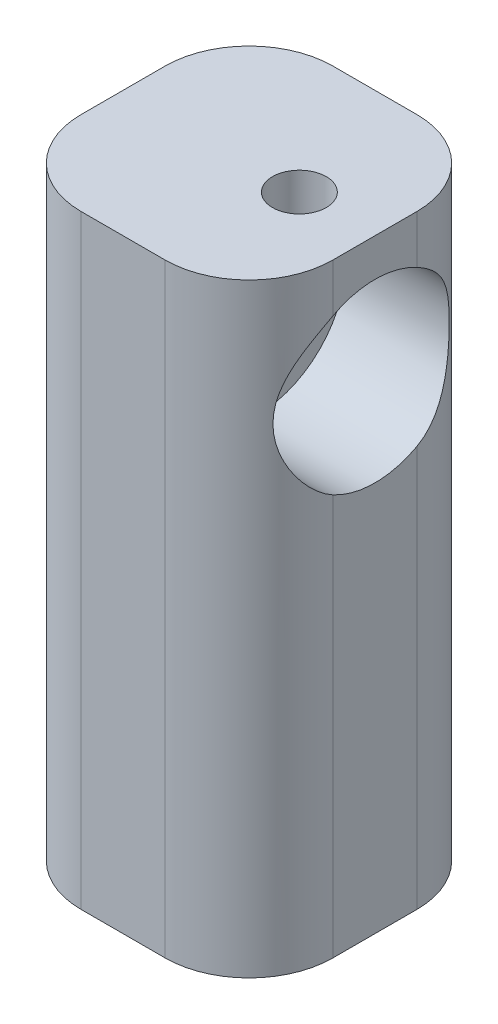
ISO-10303-21;
HEADER;
FILE_DESCRIPTION(('STEP AP214'),'2;1');
FILE_NAME('part.step','',(''),(''),'','','');
FILE_SCHEMA(('AUTOMOTIVE_DESIGN { 1 0 10303 214 1 1 1 1 }'));
ENDSEC;
DATA;
#1=APPLICATION_CONTEXT('core data for automotive mechanical design processes');
#2=APPLICATION_PROTOCOL_DEFINITION('international standard','automotive_design',2000,#1);
#3=PRODUCT_CONTEXT('',#1,'mechanical');
#4=PRODUCT('Part','Part','',(#3));
#5=PRODUCT_RELATED_PRODUCT_CATEGORY('part','',(#4));
#6=PRODUCT_DEFINITION_FORMATION('','',#4);
#7=PRODUCT_DEFINITION_CONTEXT('part definition',#1,'design');
#8=PRODUCT_DEFINITION('design','',#6,#7);
#9=PRODUCT_DEFINITION_SHAPE('','',#8);
#10=(LENGTH_UNIT() NAMED_UNIT(*) SI_UNIT(.MILLI.,.METRE.));
#11=(NAMED_UNIT(*) PLANE_ANGLE_UNIT() SI_UNIT($,.RADIAN.));
#12=(NAMED_UNIT(*) SI_UNIT($,.STERADIAN.) SOLID_ANGLE_UNIT());
#13=UNCERTAINTY_MEASURE_WITH_UNIT(LENGTH_MEASURE(1.E-05),#10,'distance_accuracy_value','');
#14=(GEOMETRIC_REPRESENTATION_CONTEXT(3) GLOBAL_UNCERTAINTY_ASSIGNED_CONTEXT((#13)) GLOBAL_UNIT_ASSIGNED_CONTEXT((#10,
#11,#12)) REPRESENTATION_CONTEXT('',''));
#15=CARTESIAN_POINT('',(0.,0.,0.));
#16=DIRECTION('',(0.,0.,1.));
#17=DIRECTION('',(1.,0.,0.));
#18=AXIS2_PLACEMENT_3D('',#15,#16,#17);
#19=CARTESIAN_POINT('',(-7.5,28.5,0.));
#20=DIRECTION('',(1.,0.,0.));
#21=DIRECTION('',(0.,0.,-1.));
#22=AXIS2_PLACEMENT_3D('',#19,#20,#21);
#23=CYLINDRICAL_SURFACE('',#22,2.5);
#24=CARTESIAN_POINT('',(-7.5,28.5,0.));
#25=DIRECTION('',(1.,0.,0.));
#26=DIRECTION('',(0.,0.,-1.));
#27=AXIS2_PLACEMENT_3D('',#24,#25,#26);
#28=CIRCLE('',#27,2.5);
#29=CARTESIAN_POINT('',(-7.5,28.5,-2.5));
#30=VERTEX_POINT('',#29);
#31=CARTESIAN_POINT('',(-7.5,28.5,2.5));
#32=VERTEX_POINT('',#31);
#33=EDGE_CURVE('E187',#30,#32,#28,.T.);
#34=ORIENTED_EDGE('',*,*,#33,.F.);
#35=EDGE_CURVE('E218',#32,#30,#28,.T.);
#36=ORIENTED_EDGE('',*,*,#35,.F.);
#37=EDGE_LOOP('',(#34,#36));
#38=FACE_BOUND('',#37,.T.);
#39=CARTESIAN_POINT('',(0.5,28.5,0.));
#40=DIRECTION('',(1.,0.,0.));
#41=DIRECTION('',(0.,0.,-1.));
#42=AXIS2_PLACEMENT_3D('',#39,#40,#41);
#43=CIRCLE('',#42,2.5);
#44=CARTESIAN_POINT('',(0.5,28.5,-2.5));
#45=VERTEX_POINT('',#44);
#46=EDGE_CURVE('E133',#45,#45,#43,.F.);
#47=ORIENTED_EDGE('',*,*,#46,.F.);
#48=EDGE_LOOP('',(#47));
#49=FACE_BOUND('',#48,.T.);
#50=ADVANCED_FACE('F40',(#38,#49),#23,.F.);
#51=CARTESIAN_POINT('',(7.5,20.,7.5));
#52=DIRECTION('',(-1.,0.,0.));
#53=DIRECTION('',(0.,0.,1.));
#54=AXIS2_PLACEMENT_3D('',#51,#52,#53);
#55=PLANE('',#54);
#56=DIRECTION('',(0.,-1.,0.));
#57=VECTOR('',#56,1.);
#58=CARTESIAN_POINT('',(7.5,20.,-2.5));
#59=LINE('',#58,#57);
#60=CARTESIAN_POINT('',(7.5,0.,-2.5));
#61=VERTEX_POINT('',#60);
#62=CARTESIAN_POINT('',(7.5,23.8834536718452,-2.5));
#63=VERTEX_POINT('',#62);
#64=EDGE_CURVE('E149',#61,#63,#59,.F.);
#65=ORIENTED_EDGE('',*,*,#64,.T.);
#66=CARTESIAN_POINT('',(7.5,28.5,0.));
#67=DIRECTION('',(1.,0.,0.));
#68=DIRECTION('',(0.,0.,-1.));
#69=AXIS2_PLACEMENT_3D('',#66,#67,#68);
#70=CIRCLE('',#69,5.25);
#71=CARTESIAN_POINT('',(7.5,23.8834536718452,2.5));
#72=VERTEX_POINT('',#71);
#73=EDGE_CURVE('E128',#72,#63,#70,.T.);
#74=ORIENTED_EDGE('',*,*,#73,.F.);
#75=DIRECTION('',(0.,-1.,0.));
#76=VECTOR('',#75,1.);
#77=CARTESIAN_POINT('',(7.5,20.,2.5));
#78=LINE('',#77,#76);
#79=CARTESIAN_POINT('',(7.5,0.,2.5));
#80=VERTEX_POINT('',#79);
#81=EDGE_CURVE('E152',#72,#80,#78,.T.);
#82=ORIENTED_EDGE('',*,*,#81,.T.);
#83=DIRECTION('',(0.,0.,-1.));
#84=VECTOR('',#83,1.);
#85=CARTESIAN_POINT('',(7.5,0.,7.5));
#86=LINE('',#85,#84);
#87=EDGE_CURVE('E242',#80,#61,#86,.T.);
#88=ORIENTED_EDGE('',*,*,#87,.T.);
#89=EDGE_LOOP('',(#65,#74,#82,#88));
#90=FACE_BOUND('',#89,.T.);
#91=ADVANCED_FACE('F203',(#90),#55,.F.);
#92=CARTESIAN_POINT('',(-7.5,20.,7.5));
#93=DIRECTION('',(1.,0.,0.));
#94=DIRECTION('',(0.,0.,-1.));
#95=AXIS2_PLACEMENT_3D('',#92,#93,#94);
#96=PLANE('',#95);
#97=DIRECTION('',(0.,0.,1.));
#98=VECTOR('',#97,1.);
#99=CARTESIAN_POINT('',(-7.5,36.,7.5));
#100=LINE('',#99,#98);
#101=CARTESIAN_POINT('',(-7.5,36.,-2.5));
#102=VERTEX_POINT('',#101);
#103=CARTESIAN_POINT('',(-7.5,36.,2.5));
#104=VERTEX_POINT('',#103);
#105=EDGE_CURVE('E227',#102,#104,#100,.T.);
#106=ORIENTED_EDGE('',*,*,#105,.F.);
#107=DIRECTION('',(0.,-1.,0.));
#108=VECTOR('',#107,1.);
#109=CARTESIAN_POINT('',(-7.5,20.,-2.5));
#110=LINE('',#109,#108);
#111=EDGE_CURVE('E254',#102,#30,#110,.T.);
#112=ORIENTED_EDGE('',*,*,#111,.T.);
#113=ORIENTED_EDGE('',*,*,#33,.T.);
#114=DIRECTION('',(0.,-1.,0.));
#115=VECTOR('',#114,1.);
#116=CARTESIAN_POINT('',(-7.5,20.,2.5));
#117=LINE('',#116,#115);
#118=EDGE_CURVE('E248',#32,#104,#117,.F.);
#119=ORIENTED_EDGE('',*,*,#118,.T.);
#120=EDGE_LOOP('',(#106,#112,#113,#119));
#121=FACE_BOUND('',#120,.T.);
#122=ADVANCED_FACE('F208',(#121),#96,.F.);
#123=CARTESIAN_POINT('',(0.,0.,0.));
#124=DIRECTION('',(0.,1.,0.));
#125=DIRECTION('',(0.,0.,1.));
#126=AXIS2_PLACEMENT_3D('',#123,#124,#125);
#127=PLANE('',#126);
#128=DIRECTION('',(0.,0.,1.));
#129=VECTOR('',#128,1.);
#130=CARTESIAN_POINT('',(-7.5,0.,7.5));
#131=LINE('',#130,#129);
#132=CARTESIAN_POINT('',(-7.5,0.,-2.5));
#133=VERTEX_POINT('',#132);
#134=CARTESIAN_POINT('',(-7.5,0.,2.5));
#135=VERTEX_POINT('',#134);
#136=EDGE_CURVE('E237',#133,#135,#131,.T.);
#137=ORIENTED_EDGE('',*,*,#136,.F.);
#138=CARTESIAN_POINT('',(-2.5,0.,-2.5));
#139=DIRECTION('',(0.,1.,0.));
#140=DIRECTION('',(0.,0.,1.));
#141=AXIS2_PLACEMENT_3D('',#138,#139,#140);
#142=CIRCLE('',#141,5.);
#143=CARTESIAN_POINT('',(-2.5,0.,-7.5));
#144=VERTEX_POINT('',#143);
#145=EDGE_CURVE('E262',#133,#144,#142,.F.);
#146=ORIENTED_EDGE('',*,*,#145,.T.);
#147=DIRECTION('',(-1.,0.,0.));
#148=VECTOR('',#147,1.);
#149=CARTESIAN_POINT('',(7.5,0.,-7.5));
#150=LINE('',#149,#148);
#151=CARTESIAN_POINT('',(2.5,0.,-7.5));
#152=VERTEX_POINT('',#151);
#153=EDGE_CURVE('E245',#152,#144,#150,.T.);
#154=ORIENTED_EDGE('',*,*,#153,.F.);
#155=CARTESIAN_POINT('',(2.5,0.,-2.5));
#156=DIRECTION('',(0.,1.,0.));
#157=DIRECTION('',(0.,0.,1.));
#158=AXIS2_PLACEMENT_3D('',#155,#156,#157);
#159=CIRCLE('',#158,5.);
#160=EDGE_CURVE('E260',#152,#61,#159,.F.);
#161=ORIENTED_EDGE('',*,*,#160,.T.);
#162=ORIENTED_EDGE('',*,*,#87,.F.);
#163=CARTESIAN_POINT('',(2.5,0.,2.5));
#164=DIRECTION('',(0.,1.,0.));
#165=DIRECTION('',(0.,0.,1.));
#166=AXIS2_PLACEMENT_3D('',#163,#164,#165);
#167=CIRCLE('',#166,5.);
#168=CARTESIAN_POINT('',(2.5,0.,7.5));
#169=VERTEX_POINT('',#168);
#170=EDGE_CURVE('E256',#80,#169,#167,.F.);
#171=ORIENTED_EDGE('',*,*,#170,.T.);
#172=DIRECTION('',(1.,0.,0.));
#173=VECTOR('',#172,1.);
#174=CARTESIAN_POINT('',(7.5,0.,7.5));
#175=LINE('',#174,#173);
#176=CARTESIAN_POINT('',(-2.5,0.,7.5));
#177=VERTEX_POINT('',#176);
#178=EDGE_CURVE('E240',#177,#169,#175,.T.);
#179=ORIENTED_EDGE('',*,*,#178,.F.);
#180=CARTESIAN_POINT('',(-2.5,0.,2.5));
#181=DIRECTION('',(0.,1.,0.));
#182=DIRECTION('',(0.,0.,1.));
#183=AXIS2_PLACEMENT_3D('',#180,#181,#182);
#184=CIRCLE('',#183,5.);
#185=EDGE_CURVE('E258',#177,#135,#184,.F.);
#186=ORIENTED_EDGE('',*,*,#185,.T.);
#187=EDGE_LOOP('',(#137,#146,#154,#161,#162,#171,#179,#186));
#188=FACE_BOUND('',#187,.T.);
#189=CARTESIAN_POINT('',(0.,0.,0.));
#190=DIRECTION('',(0.,1.,0.));
#191=DIRECTION('',(0.,0.,1.));
#192=AXIS2_PLACEMENT_3D('',#189,#190,#191);
#193=CIRCLE('',#192,4.25);
#194=CARTESIAN_POINT('',(0.,0.,4.25));
#195=VERTEX_POINT('',#194);
#196=EDGE_CURVE('E234',#195,#195,#193,.T.);
#197=ORIENTED_EDGE('',*,*,#196,.T.);
#198=EDGE_LOOP('',(#197));
#199=FACE_BOUND('',#198,.T.);
#200=ADVANCED_FACE('F280',(#188,#199),#127,.F.);
#201=ORIENTED_EDGE('',*,*,#35,.T.);
#202=DIRECTION('',(0.,-1.,0.));
#203=VECTOR('',#202,1.);
#204=CARTESIAN_POINT('',(-7.5,20.,-2.5));
#205=LINE('',#204,#203);
#206=EDGE_CURVE('E252',#30,#133,#205,.T.);
#207=ORIENTED_EDGE('',*,*,#206,.T.);
#208=ORIENTED_EDGE('',*,*,#136,.T.);
#209=DIRECTION('',(0.,-1.,0.));
#210=VECTOR('',#209,1.);
#211=CARTESIAN_POINT('',(-7.5,20.,2.5));
#212=LINE('',#211,#210);
#213=EDGE_CURVE('E250',#135,#32,#212,.F.);
#214=ORIENTED_EDGE('',*,*,#213,.T.);
#215=EDGE_LOOP('',(#201,#207,#208,#214));
#216=FACE_BOUND('',#215,.T.);
#217=ADVANCED_FACE('F291',(#216),#96,.F.);
#218=CARTESIAN_POINT('',(7.5,20.,7.5));
#219=DIRECTION('',(0.,0.,-1.));
#220=DIRECTION('',(-1.,0.,0.));
#221=AXIS2_PLACEMENT_3D('',#218,#219,#220);
#222=PLANE('',#221);
#223=DIRECTION('',(1.,0.,0.));
#224=VECTOR('',#223,1.);
#225=CARTESIAN_POINT('',(-7.5,36.,7.5));
#226=LINE('',#225,#224);
#227=CARTESIAN_POINT('',(-2.5,36.,7.5));
#228=VERTEX_POINT('',#227);
#229=CARTESIAN_POINT('',(2.5,36.,7.5));
#230=VERTEX_POINT('',#229);
#231=EDGE_CURVE('E232',#228,#230,#226,.T.);
#232=ORIENTED_EDGE('',*,*,#231,.F.);
#233=DIRECTION('',(0.,-1.,0.));
#234=VECTOR('',#233,1.);
#235=CARTESIAN_POINT('',(-2.5,20.,7.5));
#236=LINE('',#235,#234);
#237=EDGE_CURVE('E157',#228,#177,#236,.T.);
#238=ORIENTED_EDGE('',*,*,#237,.T.);
#239=ORIENTED_EDGE('',*,*,#178,.T.);
#240=DIRECTION('',(0.,-1.,0.));
#241=VECTOR('',#240,1.);
#242=CARTESIAN_POINT('',(2.5,20.,7.5));
#243=LINE('',#242,#241);
#244=EDGE_CURVE('E64',#169,#230,#243,.F.);
#245=ORIENTED_EDGE('',*,*,#244,.T.);
#246=EDGE_LOOP('',(#232,#238,#239,#245));
#247=FACE_BOUND('',#246,.T.);
#248=ADVANCED_FACE('F288',(#247),#222,.F.);
#249=DIRECTION('',(0.,-1.,0.));
#250=VECTOR('',#249,1.);
#251=CARTESIAN_POINT('',(7.5,20.,2.5));
#252=LINE('',#251,#250);
#253=CARTESIAN_POINT('',(7.5,36.,2.5));
#254=VERTEX_POINT('',#253);
#255=CARTESIAN_POINT('',(7.5,33.1165463281549,2.5));
#256=VERTEX_POINT('',#255);
#257=EDGE_CURVE('E143',#254,#256,#252,.T.);
#258=ORIENTED_EDGE('',*,*,#257,.T.);
#259=CARTESIAN_POINT('',(7.5,33.1165463281548,-2.5));
#260=VERTEX_POINT('',#259);
#261=EDGE_CURVE('E56',#260,#256,#70,.T.);
#262=ORIENTED_EDGE('',*,*,#261,.F.);
#263=DIRECTION('',(0.,-1.,0.));
#264=VECTOR('',#263,1.);
#265=CARTESIAN_POINT('',(7.5,20.,-2.5));
#266=LINE('',#265,#264);
#267=CARTESIAN_POINT('',(7.5,36.,-2.5));
#268=VERTEX_POINT('',#267);
#269=EDGE_CURVE('E140',#260,#268,#266,.F.);
#270=ORIENTED_EDGE('',*,*,#269,.T.);
#271=DIRECTION('',(0.,0.,-1.));
#272=VECTOR('',#271,1.);
#273=CARTESIAN_POINT('',(7.5,36.,7.5));
#274=LINE('',#273,#272);
#275=EDGE_CURVE('E221',#254,#268,#274,.T.);
#276=ORIENTED_EDGE('',*,*,#275,.F.);
#277=EDGE_LOOP('',(#258,#262,#270,#276));
#278=FACE_BOUND('',#277,.T.);
#279=ADVANCED_FACE('F138',(#278),#55,.F.);
#280=CARTESIAN_POINT('',(7.5,20.,-7.5));
#281=DIRECTION('',(0.,0.,1.));
#282=DIRECTION('',(1.,0.,0.));
#283=AXIS2_PLACEMENT_3D('',#280,#281,#282);
#284=PLANE('',#283);
#285=ORIENTED_EDGE('',*,*,#153,.T.);
#286=DIRECTION('',(0.,-1.,0.));
#287=VECTOR('',#286,1.);
#288=CARTESIAN_POINT('',(-2.5,20.,-7.5));
#289=LINE('',#288,#287);
#290=CARTESIAN_POINT('',(-2.5,36.,-7.5));
#291=VERTEX_POINT('',#290);
#292=EDGE_CURVE('E267',#144,#291,#289,.F.);
#293=ORIENTED_EDGE('',*,*,#292,.T.);
#294=DIRECTION('',(-1.,0.,0.));
#295=VECTOR('',#294,1.);
#296=CARTESIAN_POINT('',(-7.5,36.,-7.5));
#297=LINE('',#296,#295);
#298=CARTESIAN_POINT('',(2.5,36.,-7.5));
#299=VERTEX_POINT('',#298);
#300=EDGE_CURVE('E224',#299,#291,#297,.T.);
#301=ORIENTED_EDGE('',*,*,#300,.F.);
#302=DIRECTION('',(0.,-1.,0.));
#303=VECTOR('',#302,1.);
#304=CARTESIAN_POINT('',(2.5,20.,-7.5));
#305=LINE('',#304,#303);
#306=EDGE_CURVE('E264',#299,#152,#305,.T.);
#307=ORIENTED_EDGE('',*,*,#306,.T.);
#308=EDGE_LOOP('',(#285,#293,#301,#307));
#309=FACE_BOUND('',#308,.T.);
#310=ADVANCED_FACE('F299',(#309),#284,.F.);
#311=CARTESIAN_POINT('',(0.,20.,0.));
#312=DIRECTION('',(0.,-1.,0.));
#313=DIRECTION('',(0.,0.,-1.));
#314=AXIS2_PLACEMENT_3D('',#311,#312,#313);
#315=CYLINDRICAL_SURFACE('',#314,4.25);
#316=CARTESIAN_POINT('',(0.,10.0000000000071,0.));
#317=DIRECTION('',(0.,-1.,0.));
#318=DIRECTION('',(0.,0.,-1.));
#319=AXIS2_PLACEMENT_3D('',#316,#317,#318);
#320=CIRCLE('',#319,4.25);
#321=CARTESIAN_POINT('',(0.,10.0000000000071,-4.25));
#322=VERTEX_POINT('',#321);
#323=EDGE_CURVE('E49',#322,#322,#320,.F.);
#324=ORIENTED_EDGE('',*,*,#323,.T.);
#325=EDGE_LOOP('',(#324));
#326=FACE_BOUND('',#325,.T.);
#327=ORIENTED_EDGE('',*,*,#196,.F.);
#328=EDGE_LOOP('',(#327));
#329=FACE_BOUND('',#328,.T.);
#330=ADVANCED_FACE('F301',(#326,#329),#315,.F.);
#331=CARTESIAN_POINT('',(0.,20.,0.));
#332=DIRECTION('',(0.,-1.,0.));
#333=DIRECTION('',(0.,0.,-1.));
#334=AXIS2_PLACEMENT_3D('',#331,#332,#333);
#335=PLANE('',#334);
#336=CARTESIAN_POINT('',(0.,20.,0.));
#337=DIRECTION('',(0.,-1.,0.));
#338=DIRECTION('',(0.,0.,-1.));
#339=AXIS2_PLACEMENT_3D('',#336,#337,#338);
#340=CIRCLE('',#339,4.07544935071791);
#341=CARTESIAN_POINT('',(0.,20.,-4.07544935071791));
#342=VERTEX_POINT('',#341);
#343=EDGE_CURVE('E11',#342,#342,#340,.T.);
#344=ORIENTED_EDGE('',*,*,#343,.T.);
#345=EDGE_LOOP('',(#344));
#346=FACE_BOUND('',#345,.T.);
#347=ADVANCED_FACE('F307',(#346),#335,.T.);
#348=CARTESIAN_POINT('',(0.,36.,0.));
#349=DIRECTION('',(0.,-1.,0.));
#350=DIRECTION('',(0.,0.,-1.));
#351=AXIS2_PLACEMENT_3D('',#348,#349,#350);
#352=PLANE('',#351);
#353=CARTESIAN_POINT('',(3.,36.,0.));
#354=DIRECTION('',(0.,1.,0.));
#355=DIRECTION('',(0.,0.,1.));
#356=AXIS2_PLACEMENT_3D('',#353,#354,#355);
#357=CIRCLE('',#356,1.6);
#358=CARTESIAN_POINT('',(3.,36.,1.6));
#359=VERTEX_POINT('',#358);
#360=EDGE_CURVE('E504',#359,#359,#357,.T.);
#361=ORIENTED_EDGE('',*,*,#360,.F.);
#362=EDGE_LOOP('',(#361));
#363=FACE_BOUND('',#362,.T.);
#364=ORIENTED_EDGE('',*,*,#300,.T.);
#365=CARTESIAN_POINT('',(-2.5,36.,-2.5));
#366=DIRECTION('',(0.,-1.,0.));
#367=DIRECTION('',(0.,0.,-1.));
#368=AXIS2_PLACEMENT_3D('',#365,#366,#367);
#369=CIRCLE('',#368,5.);
#370=EDGE_CURVE('E274',#291,#102,#369,.F.);
#371=ORIENTED_EDGE('',*,*,#370,.T.);
#372=ORIENTED_EDGE('',*,*,#105,.T.);
#373=CARTESIAN_POINT('',(-2.5,36.,2.5));
#374=DIRECTION('',(0.,-1.,0.));
#375=DIRECTION('',(0.,0.,-1.));
#376=AXIS2_PLACEMENT_3D('',#373,#374,#375);
#377=CIRCLE('',#376,5.);
#378=EDGE_CURVE('E271',#104,#228,#377,.F.);
#379=ORIENTED_EDGE('',*,*,#378,.T.);
#380=ORIENTED_EDGE('',*,*,#231,.T.);
#381=CARTESIAN_POINT('',(2.5,36.,2.5));
#382=DIRECTION('',(0.,-1.,0.));
#383=DIRECTION('',(0.,0.,-1.));
#384=AXIS2_PLACEMENT_3D('',#381,#382,#383);
#385=CIRCLE('',#384,5.);
#386=EDGE_CURVE('E269',#230,#254,#385,.F.);
#387=ORIENTED_EDGE('',*,*,#386,.T.);
#388=ORIENTED_EDGE('',*,*,#275,.T.);
#389=CARTESIAN_POINT('',(2.5,36.,-2.5));
#390=DIRECTION('',(0.,-1.,0.));
#391=DIRECTION('',(0.,0.,-1.));
#392=AXIS2_PLACEMENT_3D('',#389,#390,#391);
#393=CIRCLE('',#392,5.);
#394=EDGE_CURVE('E148',#268,#299,#393,.F.);
#395=ORIENTED_EDGE('',*,*,#394,.T.);
#396=EDGE_LOOP('',(#364,#371,#372,#379,#380,#387,#388,#395));
#397=FACE_BOUND('',#396,.T.);
#398=ADVANCED_FACE('F285',(#363,#397),#352,.F.);
#399=CARTESIAN_POINT('',(-2.5,20.,-2.5));
#400=DIRECTION('',(0.,-1.,0.));
#401=DIRECTION('',(0.,0.,-1.));
#402=AXIS2_PLACEMENT_3D('',#399,#400,#401);
#403=CYLINDRICAL_SURFACE('',#402,5.);
#404=ORIENTED_EDGE('',*,*,#370,.F.);
#405=ORIENTED_EDGE('',*,*,#292,.F.);
#406=ORIENTED_EDGE('',*,*,#145,.F.);
#407=ORIENTED_EDGE('',*,*,#206,.F.);
#408=ORIENTED_EDGE('',*,*,#111,.F.);
#409=EDGE_LOOP('',(#404,#405,#406,#407,#408));
#410=FACE_BOUND('',#409,.T.);
#411=ADVANCED_FACE('F193',(#410),#403,.T.);
#412=CARTESIAN_POINT('',(2.5,20.,-2.5));
#413=DIRECTION('',(0.,-1.,0.));
#414=DIRECTION('',(0.,0.,-1.));
#415=AXIS2_PLACEMENT_3D('',#412,#413,#414);
#416=CYLINDRICAL_SURFACE('',#415,5.);
#417=CARTESIAN_POINT('',(7.5,23.8834536718452,-2.5));
#418=CARTESIAN_POINT('',(7.50001612592816,23.9489170996642,-2.62094312948143));
#419=CARTESIAN_POINT('',(7.49561350698826,24.0191358168602,-2.73920823782808));
#420=CARTESIAN_POINT('',(7.47925108282359,24.1682489406027,-2.96936538800303));
#421=CARTESIAN_POINT('',(7.46730189694266,24.2471310276245,-3.08126614479054));
#422=CARTESIAN_POINT('',(7.43723077737022,24.4123129900141,-3.29722322115146));
#423=CARTESIAN_POINT('',(7.41915498633908,24.4985539110211,-3.40133127657989));
#424=CARTESIAN_POINT('',(7.37810813738134,24.6782558521651,-3.60207464711724));
#425=CARTESIAN_POINT('',(7.35513537703109,24.7717193760067,-3.69870734746689));
#426=CARTESIAN_POINT('',(7.28104418962701,25.0610352142529,-3.97580017031572));
#427=CARTESIAN_POINT('',(7.22454423508176,25.2668058326725,-4.14474399045034));
#428=CARTESIAN_POINT('',(7.13659915730087,25.5921123752446,-4.37314300585691));
#429=CARTESIAN_POINT('',(7.10669473738877,25.7035392066861,-4.44521388092611));
#430=CARTESIAN_POINT('',(7.04707156816132,25.9316142319222,-4.58077201355807));
#431=CARTESIAN_POINT('',(7.01735284176505,26.0482630562771,-4.64425823077419));
#432=CARTESIAN_POINT('',(6.95570060911491,26.30149111366,-4.76985360313681));
#433=CARTESIAN_POINT('',(6.92396662717453,26.4387174056805,-4.83075908753674));
#434=CARTESIAN_POINT('',(6.86422076612168,26.7185412243529,-4.94079855564156));
#435=CARTESIAN_POINT('',(6.83620727946467,26.8611363968216,-4.98993763077189));
#436=CARTESIAN_POINT('',(6.78571193069521,27.1506678549064,-5.0758800841225));
#437=CARTESIAN_POINT('',(6.76321957526284,27.2975953016677,-5.11270691169578));
#438=CARTESIAN_POINT('',(6.72528257259838,27.5949596101268,-5.17362747939411));
#439=CARTESIAN_POINT('',(6.7098365636209,27.7453957878311,-5.19772367992565));
#440=CARTESIAN_POINT('',(6.68809106585438,28.0361524341153,-5.23134756982028));
#441=CARTESIAN_POINT('',(6.68115291365005,28.1763071127748,-5.24189582746853));
#442=CARTESIAN_POINT('',(6.67470398720377,28.4571805028804,-5.25170549297111));
#443=CARTESIAN_POINT('',(6.67519282479885,28.5978991844652,-5.25096749068867));
#444=CARTESIAN_POINT('',(6.68356832318123,28.8786239163198,-5.23821387553473));
#445=CARTESIAN_POINT('',(6.69145607028935,29.018629858909,-5.22619660662145));
#446=CARTESIAN_POINT('',(6.71407242136325,29.2966472883421,-5.19109891697421));
#447=CARTESIAN_POINT('',(6.72880101005364,29.4346587796389,-5.16801852094384));
#448=CARTESIAN_POINT('',(6.77794993127236,29.8138635394073,-5.08897045417952));
#449=CARTESIAN_POINT('',(6.81877831128331,30.0518949329367,-5.02138401238178));
#450=CARTESIAN_POINT('',(6.91195922212495,30.5141900320537,-4.85449764152848));
#451=CARTESIAN_POINT('',(6.9643249924367,30.7384375390237,-4.75516121896676));
#452=CARTESIAN_POINT('',(7.08080637927167,31.2032622907283,-4.50934065327327));
#453=CARTESIAN_POINT('',(7.14549666014782,31.4411226196983,-4.35797925403861));
#454=CARTESIAN_POINT('',(7.2673359718543,31.8905147776623,-4.01819940330588));
#455=CARTESIAN_POINT('',(7.3245000564729,32.102099113848,-3.82985686157804));
#456=CARTESIAN_POINT('',(7.39109619764138,32.3774115791303,-3.54139017392428));
#457=CARTESIAN_POINT('',(7.4087014265485,32.4542599102459,-3.45538615411306));
#458=CARTESIAN_POINT('',(7.43990811328347,32.6024448087466,-3.27807574003952));
#459=CARTESIAN_POINT('',(7.45351093888116,32.6737832529039,-3.18677116997295));
#460=CARTESIAN_POINT('',(7.47595930529501,32.8108199375756,-2.99881763555194));
#461=CARTESIAN_POINT('',(7.4847832570217,32.87649147376,-2.90214655763962));
#462=CARTESIAN_POINT('',(7.49681119490845,33.001447747468,-2.70429574449518));
#463=CARTESIAN_POINT('',(7.50000944428551,33.0607259076404,-2.60311151465108));
#464=CARTESIAN_POINT('',(7.5,33.1165463281549,-2.5));
#465=B_SPLINE_CURVE_WITH_KNOTS('',3,(#417,#418,#419,#420,#421,#422,#423,#424,#425,#426,#427,
#428,#429,#430,#431,#432,#433,#434,#435,#436,#437,#438,#439,#440,#441,#442,#443,#444,#445,#446,
#447,#448,#449,#450,#451,#452,#453,#454,#455,#456,#457,#458,#459,#460,#461,#462,#463,#464),
.UNSPECIFIED.,.F.,.F.,(4,2,2,2,2,2,2,2,2,2,2,2,2,2,2,2,2,2,2,2,2,2,2,4),(0.,0.412258254766337,
0.823937678476685,1.23258299459958,1.6413706079915,2.45407993419,2.86190921941417,
3.26978788392785,3.72957922780513,4.18917125506231,4.64788291019283,5.10650587916788,
5.52803996996671,5.94955202985303,6.37112598656495,6.79269900192089,7.54188188365159,
8.29192899357395,9.15624360989174,10.0188022861485,10.3685697606661,10.7182175674521,
11.0694320428912,11.4210044604283),.UNSPECIFIED.);
#466=EDGE_CURVE('E124',#63,#260,#465,.T.);
#467=ORIENTED_EDGE('',*,*,#466,.F.);
#468=ORIENTED_EDGE('',*,*,#64,.F.);
#469=ORIENTED_EDGE('',*,*,#160,.F.);
#470=ORIENTED_EDGE('',*,*,#306,.F.);
#471=ORIENTED_EDGE('',*,*,#394,.F.);
#472=ORIENTED_EDGE('',*,*,#269,.F.);
#473=EDGE_LOOP('',(#467,#468,#469,#470,#471,#472));
#474=FACE_BOUND('',#473,.T.);
#475=ADVANCED_FACE('F146',(#474),#416,.T.);
#476=CARTESIAN_POINT('',(-2.5,20.,2.5));
#477=DIRECTION('',(0.,-1.,0.));
#478=DIRECTION('',(0.,0.,-1.));
#479=AXIS2_PLACEMENT_3D('',#476,#477,#478);
#480=CYLINDRICAL_SURFACE('',#479,5.);
#481=ORIENTED_EDGE('',*,*,#118,.F.);
#482=ORIENTED_EDGE('',*,*,#213,.F.);
#483=ORIENTED_EDGE('',*,*,#185,.F.);
#484=ORIENTED_EDGE('',*,*,#237,.F.);
#485=ORIENTED_EDGE('',*,*,#378,.F.);
#486=EDGE_LOOP('',(#481,#482,#483,#484,#485));
#487=FACE_BOUND('',#486,.T.);
#488=ADVANCED_FACE('F192',(#487),#480,.T.);
#489=CARTESIAN_POINT('',(2.5,20.,2.5));
#490=DIRECTION('',(0.,-1.,0.));
#491=DIRECTION('',(0.,0.,-1.));
#492=AXIS2_PLACEMENT_3D('',#489,#490,#491);
#493=CYLINDRICAL_SURFACE('',#492,5.);
#494=CARTESIAN_POINT('',(7.5,33.1165463281549,2.5));
#495=CARTESIAN_POINT('',(7.50001612592816,33.0510829003358,2.62094312948142));
#496=CARTESIAN_POINT('',(7.49561350698826,32.9808641831398,2.73920823782807));
#497=CARTESIAN_POINT('',(7.47925108282359,32.8317510593974,2.96936538800302));
#498=CARTESIAN_POINT('',(7.46730189694266,32.7528689723755,3.08126614479054));
#499=CARTESIAN_POINT('',(7.43723077737022,32.5876870099859,3.29722322115146));
#500=CARTESIAN_POINT('',(7.41915498633908,32.5014460889789,3.40133127657989));
#501=CARTESIAN_POINT('',(7.37810813738134,32.3217441478349,3.60207464711724));
#502=CARTESIAN_POINT('',(7.35513537703109,32.2282806239933,3.69870734746689));
#503=CARTESIAN_POINT('',(7.28104418962702,31.9389647857471,3.97580017031572));
#504=CARTESIAN_POINT('',(7.22454423508177,31.7331941673275,4.14474399045034));
#505=CARTESIAN_POINT('',(7.13659915730087,31.4078876247554,4.37314300585691));
#506=CARTESIAN_POINT('',(7.10669473738877,31.296460793314,4.44521388092611));
#507=CARTESIAN_POINT('',(7.04707156816132,31.0683857680778,4.58077201355807));
#508=CARTESIAN_POINT('',(7.01735284176505,30.9517369437229,4.64425823077419));
#509=CARTESIAN_POINT('',(6.95570060911492,30.6985088863401,4.76985360313681));
#510=CARTESIAN_POINT('',(6.92396662717454,30.5612825943195,4.83075908753674));
#511=CARTESIAN_POINT('',(6.86422076612168,30.2814587756472,4.94079855564155));
#512=CARTESIAN_POINT('',(6.83620727946467,30.1388636031784,4.98993763077189));
#513=CARTESIAN_POINT('',(6.78571193069521,29.8493321450936,5.0758800841225));
#514=CARTESIAN_POINT('',(6.76321957526284,29.7024046983323,5.11270691169578));
#515=CARTESIAN_POINT('',(6.72528257259838,29.4050403898732,5.17362747939411));
#516=CARTESIAN_POINT('',(6.70983656362089,29.2546042121689,5.19772367992565));
#517=CARTESIAN_POINT('',(6.68809106585438,28.9638475658847,5.23134756982028));
#518=CARTESIAN_POINT('',(6.68115291365004,28.8236928872252,5.24189582746853));
#519=CARTESIAN_POINT('',(6.67470398720377,28.5428194971196,5.25170549297111));
#520=CARTESIAN_POINT('',(6.67519282479885,28.4021008155348,5.25096749068867));
#521=CARTESIAN_POINT('',(6.68356832318123,28.1213760836803,5.23821387553474));
#522=CARTESIAN_POINT('',(6.69145607028935,27.9813701410911,5.22619660662145));
#523=CARTESIAN_POINT('',(6.71407242136325,27.7033527116579,5.19109891697421));
#524=CARTESIAN_POINT('',(6.72880101005364,27.5653412203611,5.16801852094384));
#525=CARTESIAN_POINT('',(6.77794993127236,27.1861364605927,5.08897045417952));
#526=CARTESIAN_POINT('',(6.81877831128331,26.9481050670633,5.02138401238178));
#527=CARTESIAN_POINT('',(6.91195922212495,26.4858099679463,4.85449764152848));
#528=CARTESIAN_POINT('',(6.9643249924367,26.2615624609763,4.75516121896676));
#529=CARTESIAN_POINT('',(7.08080637927167,25.7967377092717,4.50934065327327));
#530=CARTESIAN_POINT('',(7.14549666014782,25.5588773803017,4.35797925403861));
#531=CARTESIAN_POINT('',(7.2673359718543,25.1094852223377,4.01819940330588));
#532=CARTESIAN_POINT('',(7.3245000564729,24.897900886152,3.82985686157805));
#533=CARTESIAN_POINT('',(7.39109619764138,24.6225884208697,3.54139017392428));
#534=CARTESIAN_POINT('',(7.4087014265485,24.5457400897541,3.45538615411307));
#535=CARTESIAN_POINT('',(7.43990811328347,24.3975551912535,3.27807574003953));
#536=CARTESIAN_POINT('',(7.45351093888116,24.3262167470961,3.18677116997296));
#537=CARTESIAN_POINT('',(7.47595930529501,24.1891800624244,2.99881763555194));
#538=CARTESIAN_POINT('',(7.4847832570217,24.12350852624,2.90214655763962));
#539=CARTESIAN_POINT('',(7.49681119490845,23.998552252532,2.70429574449519));
#540=CARTESIAN_POINT('',(7.50000944428551,23.9392740923596,2.60311151465108));
#541=CARTESIAN_POINT('',(7.5,23.8834536718452,2.5));
#542=B_SPLINE_CURVE_WITH_KNOTS('',3,(#494,#495,#496,#497,#498,#499,#500,#501,#502,#503,#504,
#505,#506,#507,#508,#509,#510,#511,#512,#513,#514,#515,#516,#517,#518,#519,#520,#521,#522,#523,
#524,#525,#526,#527,#528,#529,#530,#531,#532,#533,#534,#535,#536,#537,#538,#539,#540,#541),
.UNSPECIFIED.,.F.,.F.,(4,2,2,2,2,2,2,2,2,2,2,2,2,2,2,2,2,2,2,2,2,2,2,4),(0.,0.412258254766332,
0.82393767847668,1.23258299459958,1.64137060799149,2.45407993418999,2.86190921941418,
3.26978788392785,3.72957922780513,4.1891712550623,4.64788291019283,5.10650587916787,
5.52803996996671,5.94955202985303,6.37112598656496,6.7926990019209,7.54188188365158,
8.29192899357395,9.15624360989173,10.0188022861485,10.3685697606661,10.7182175674521,
11.0694320428912,11.4210044604284),.UNSPECIFIED.);
#543=EDGE_CURVE('E160',#256,#72,#542,.T.);
#544=ORIENTED_EDGE('',*,*,#543,.F.);
#545=ORIENTED_EDGE('',*,*,#257,.F.);
#546=ORIENTED_EDGE('',*,*,#386,.F.);
#547=ORIENTED_EDGE('',*,*,#244,.F.);
#548=ORIENTED_EDGE('',*,*,#170,.F.);
#549=ORIENTED_EDGE('',*,*,#81,.F.);
#550=EDGE_LOOP('',(#544,#545,#546,#547,#548,#549));
#551=FACE_BOUND('',#550,.T.);
#552=ADVANCED_FACE('F167',(#551),#493,.T.);
#553=CARTESIAN_POINT('',(0.499999999999999,28.5,0.));
#554=DIRECTION('',(1.,0.,0.));
#555=DIRECTION('',(0.,0.,-1.));
#556=AXIS2_PLACEMENT_3D('',#553,#554,#555);
#557=PLANE('',#556);
#558=CARTESIAN_POINT('',(0.499999999999999,28.5,0.));
#559=DIRECTION('',(1.,0.,0.));
#560=DIRECTION('',(0.,0.,-1.));
#561=AXIS2_PLACEMENT_3D('',#558,#559,#560);
#562=CIRCLE('',#561,5.25);
#563=CARTESIAN_POINT('',(0.499999999999999,28.5,-5.25));
#564=VERTEX_POINT('',#563);
#565=EDGE_CURVE('E134',#564,#564,#562,.T.);
#566=ORIENTED_EDGE('',*,*,#565,.T.);
#567=EDGE_LOOP('',(#566));
#568=FACE_BOUND('',#567,.T.);
#569=ORIENTED_EDGE('',*,*,#46,.T.);
#570=EDGE_LOOP('',(#569));
#571=FACE_BOUND('',#570,.T.);
#572=ADVANCED_FACE('F175',(#568,#571),#557,.T.);
#573=CARTESIAN_POINT('',(0.499999999999999,28.5,0.));
#574=DIRECTION('',(1.,0.,0.));
#575=DIRECTION('',(0.,0.,-1.));
#576=AXIS2_PLACEMENT_3D('',#573,#574,#575);
#577=CYLINDRICAL_SURFACE('',#576,5.25);
#578=CARTESIAN_POINT('',(3.,33.5002499937503,1.6));
#579=CARTESIAN_POINT('',(2.91239721389205,33.5002507706202,1.5999990904723));
#580=CARTESIAN_POINT('',(2.82478542331042,33.5025773440583,1.59278093953482));
#581=CARTESIAN_POINT('',(2.65212796286059,33.5115935951,1.56417651937635));
#582=CARTESIAN_POINT('',(2.56708309649893,33.5182846243591,1.54278586095044));
#583=CARTESIAN_POINT('',(2.4020844923703,33.5352031024367,1.48663397709486));
#584=CARTESIAN_POINT('',(2.32212235299232,33.5454245255843,1.45189552237401));
#585=CARTESIAN_POINT('',(2.1691403751875,33.5682438570229,1.37010941133056));
#586=CARTESIAN_POINT('',(2.09612165008135,33.580842145462,1.32305978553283));
#587=CARTESIAN_POINT('',(1.95671413182002,33.6074572271754,1.21634133084493));
#588=CARTESIAN_POINT('',(1.89058559798221,33.6215049723637,1.15634016310375));
#589=CARTESIAN_POINT('',(1.76915627881789,33.6491721271066,1.02613364364446));
#590=CARTESIAN_POINT('',(1.7138569297255,33.6627914796442,0.955926940552927));
#591=CARTESIAN_POINT('',(1.61451868820651,33.6884198283031,0.805443738429509));
#592=CARTESIAN_POINT('',(1.57074616209999,33.700388114789,0.724983862552178));
#593=CARTESIAN_POINT('',(1.49745482056518,33.7210055292094,0.55741799497321));
#594=CARTESIAN_POINT('',(1.46793282746004,33.7296553970181,0.47031348995565));
#595=CARTESIAN_POINT('',(1.42484475529891,33.7424423334311,0.294654591936758));
#596=CARTESIAN_POINT('',(1.41083421518115,33.7467048480695,0.206218519961748));
#597=CARTESIAN_POINT('',(1.39776029248202,33.7506790649751,0.0281550816007633));
#598=CARTESIAN_POINT('',(1.39869367328881,33.7503917526616,-0.0614720226252839));
#599=CARTESIAN_POINT('',(1.41518500221035,33.7453868618152,-0.236251437612727));
#600=CARTESIAN_POINT('',(1.43026144830722,33.7408151511273,-0.321454019227742));
#601=CARTESIAN_POINT('',(1.47382308099692,33.7279332269177,-0.488056572764669));
#602=CARTESIAN_POINT('',(1.50230912681381,33.7196227738365,-0.569456300650164));
#603=CARTESIAN_POINT('',(1.57220107240824,33.6999976857176,-0.727274398232027));
#604=CARTESIAN_POINT('',(1.61375639730102,33.6886485436067,-0.803622125033319));
#605=CARTESIAN_POINT('',(1.70848847618723,33.6641468528243,-0.94841311558589));
#606=CARTESIAN_POINT('',(1.76166805687661,33.6509938657981,-1.01685445052413));
#607=CARTESIAN_POINT('',(1.88062687601016,33.6236724838905,-1.14676253925675));
#608=CARTESIAN_POINT('',(1.94682274248462,33.6094845084394,-1.20784418067266));
#609=CARTESIAN_POINT('',(2.08865437456122,33.5821468702878,-1.31815064166529));
#610=CARTESIAN_POINT('',(2.16429114053144,33.5689973178612,-1.3673742031249));
#611=CARTESIAN_POINT('',(2.32389932565733,33.5451298157221,-1.45298618294187));
#612=CARTESIAN_POINT('',(2.40794771390821,33.5344379668518,-1.48923891832163));
#613=CARTESIAN_POINT('',(2.58135916674687,33.517004745497,-1.54695926738935));
#614=CARTESIAN_POINT('',(2.67072042076937,33.5102620355942,-1.56843188695446));
#615=CARTESIAN_POINT('',(2.84854647482339,33.5017853189075,-1.59525393305429));
#616=CARTESIAN_POINT('',(2.93691410644097,33.499869053204,-1.60119039968143));
#617=CARTESIAN_POINT('',(3.11338670982962,33.50075743573,-1.59841423660989));
#618=CARTESIAN_POINT('',(3.20149171792035,33.5035613976364,-1.58970373658648));
#619=CARTESIAN_POINT('',(3.37246002794906,33.5133950158976,-1.55840440179972));
#620=CARTESIAN_POINT('',(3.45540066105037,33.5203082261713,-1.53619764248402));
#621=CARTESIAN_POINT('',(3.61637174761031,33.5374597221562,-1.47898127508989));
#622=CARTESIAN_POINT('',(3.69440142430572,33.5476985323056,-1.44396964760778));
#623=CARTESIAN_POINT('',(3.84571270376533,33.5706979301465,-1.36103552326031));
#624=CARTESIAN_POINT('',(3.91880435921621,33.5835202027338,-1.3127840112771));
#625=CARTESIAN_POINT('',(4.0560675369191,33.6101110934343,-1.20512801966973));
#626=CARTESIAN_POINT('',(4.12023684845543,33.6238799448258,-1.14572078449898));
#627=CARTESIAN_POINT('',(4.24042185000316,33.6514645256409,-1.01467314761046));
#628=CARTESIAN_POINT('',(4.29602029395431,33.6652610117011,-0.942645057520923));
#629=CARTESIAN_POINT('',(4.39435369492679,33.6908054327395,-0.789950625314731));
#630=CARTESIAN_POINT('',(4.43708927426013,33.7025534668113,-0.709284701356993));
#631=CARTESIAN_POINT('',(4.50807175079648,33.7226071300748,-0.542125322965472));
#632=CARTESIAN_POINT('',(4.53642584265604,33.7309381366295,-0.455680587306064));
#633=CARTESIAN_POINT('',(4.57810685683272,33.7433309997333,-0.278952700216879));
#634=CARTESIAN_POINT('',(4.59143822952258,33.7473941205888,-0.188670693779767));
#635=CARTESIAN_POINT('',(4.60234818065415,33.7507138705239,-0.010681219485373));
#636=CARTESIAN_POINT('',(4.60053092775366,33.7501548506748,0.0769862293160212));
#637=CARTESIAN_POINT('',(4.58264581962864,33.7447302942528,0.250711489686565));
#638=CARTESIAN_POINT('',(4.56657881727784,33.7398650154175,0.33676939727496));
#639=CARTESIAN_POINT('',(4.52102838108708,33.7264293641686,0.503874821157551));
#640=CARTESIAN_POINT('',(4.49169984489914,33.7179018239792,0.584968241355738));
#641=CARTESIAN_POINT('',(4.4205978858558,33.6980224304974,0.741124488643265));
#642=CARTESIAN_POINT('',(4.3788223821884,33.6866701050263,0.816186304737854));
#643=CARTESIAN_POINT('',(4.2824281797429,33.6618685646639,0.960820530725203));
#644=CARTESIAN_POINT('',(4.22743380993727,33.6483628710378,1.03013279487483));
#645=CARTESIAN_POINT('',(4.10683420725416,33.6209509901434,1.15874655896901));
#646=CARTESIAN_POINT('',(4.04122587396458,33.6070446868327,1.21804512346695));
#647=CARTESIAN_POINT('',(3.89881733678435,33.5798961498524,1.32680059526096));
#648=CARTESIAN_POINT('',(3.82173290465882,33.5666879370262,1.37589479896595));
#649=CARTESIAN_POINT('',(3.66001748025753,33.542989812797,1.46037313684139));
#650=CARTESIAN_POINT('',(3.57538992285995,33.5324986725476,1.49576347243848));
#651=CARTESIAN_POINT('',(3.40965071528466,33.5163933573884,1.54886739999757));
#652=CARTESIAN_POINT('',(3.32902524068221,33.5103981720161,1.56798799589113));
#653=CARTESIAN_POINT('',(3.16560220902981,33.5023265480759,1.59355335087942));
#654=CARTESIAN_POINT('',(3.0828051271159,33.5002492594265,1.60000085971646));
#655=CARTESIAN_POINT('',(3.,33.5002499937503,1.6));
#656=B_SPLINE_CURVE_WITH_KNOTS('',3,(#578,#579,#580,#581,#582,#583,#584,#585,#586,#587,#588,
#589,#590,#591,#592,#593,#594,#595,#596,#597,#598,#599,#600,#601,#602,#603,#604,#605,#606,#607,
#608,#609,#610,#611,#612,#613,#614,#615,#616,#617,#618,#619,#620,#621,#622,#623,#624,#625,#626,
#627,#628,#629,#630,#631,#632,#633,#634,#635,#636,#637,#638,#639,#640,#641,#642,#643,#644,#645,
#646,#647,#648,#649,#650,#651,#652,#653,#654,#655),.UNSPECIFIED.,.T.,.F.,(4,2,2,2,2,2,2,2,2,2,2,
2,2,2,2,2,2,2,2,2,2,2,2,2,2,2,2,2,2,2,2,2,2,2,2,2,2,2,4),(0.,0.26250274419847,0.525086823138735,
0.78722492078016,1.04940497953463,1.31934645957453,1.58932371672864,1.86507982755903,
2.14077442005451,2.40834662857434,2.67586088606075,2.93458588392354,3.19332746192393,
3.45514199404132,3.71702026314431,3.98930252290071,4.26161365851622,4.53669534838329,
4.8116838249341,5.07612087228379,5.34051947369728,5.5977606943581,5.85504250099147,
6.11940995165544,6.38384278914668,6.65862171076887,6.93338733630813,7.20607369490414,
7.47867925086957,7.74046618474632,8.00223745125063,8.26102714129373,8.51986011859735,
8.78716637339329,9.05455085164922,9.33023663414923,9.60579751404944,9.85397787341709,
10.1021043779194),.UNSPECIFIED.);
#657=CARTESIAN_POINT('',(3.,33.5002499937503,1.6));
#658=VERTEX_POINT('',#657);
#659=EDGE_CURVE('E498',#658,#658,#656,.T.);
#660=ORIENTED_EDGE('',*,*,#659,.F.);
#661=EDGE_LOOP('',(#660));
#662=FACE_BOUND('',#661,.T.);
#663=ORIENTED_EDGE('',*,*,#466,.T.);
#664=ORIENTED_EDGE('',*,*,#261,.T.);
#665=ORIENTED_EDGE('',*,*,#543,.T.);
#666=ORIENTED_EDGE('',*,*,#73,.T.);
#667=EDGE_LOOP('',(#663,#664,#665,#666));
#668=FACE_BOUND('',#667,.T.);
#669=ORIENTED_EDGE('',*,*,#565,.F.);
#670=EDGE_LOOP('',(#669));
#671=FACE_BOUND('',#670,.T.);
#672=ADVANCED_FACE('F125',(#662,#668,#671),#577,.F.);
#673=CARTESIAN_POINT('',(3.,-0.001000000000001,0.));
#674=DIRECTION('',(0.,1.,0.));
#675=DIRECTION('',(0.,0.,1.));
#676=AXIS2_PLACEMENT_3D('',#673,#674,#675);
#677=CYLINDRICAL_SURFACE('',#676,1.6);
#678=ORIENTED_EDGE('',*,*,#360,.T.);
#679=EDGE_LOOP('',(#678));
#680=FACE_BOUND('',#679,.T.);
#681=ORIENTED_EDGE('',*,*,#659,.T.);
#682=EDGE_LOOP('',(#681));
#683=FACE_BOUND('',#682,.T.);
#684=ADVANCED_FACE('F174',(#680,#683),#677,.F.);
#685=CARTESIAN_POINT('',(0.,10.0000000000071,0.));
#686=DIRECTION('',(0.,-1.,0.));
#687=DIRECTION('',(0.,0.,-1.));
#688=AXIS2_PLACEMENT_3D('',#685,#686,#687);
#689=CONICAL_SURFACE('',#688,4.25,0.0174532925199468);
#690=ORIENTED_EDGE('',*,*,#343,.F.);
#691=EDGE_LOOP('',(#690));
#692=FACE_BOUND('',#691,.T.);
#693=ORIENTED_EDGE('',*,*,#323,.F.);
#694=EDGE_LOOP('',(#693));
#695=FACE_BOUND('',#694,.T.);
#696=ADVANCED_FACE('F43',(#692,#695),#689,.F.);
#697=CLOSED_SHELL('',(#50,#91,#122,#200,#217,#248,#279,#310,#330,#347,#398,#411,#475,#488,#552,
#572,#672,#684,#696));
#698=MANIFOLD_SOLID_BREP('B2',#697);
#699=ADVANCED_BREP_SHAPE_REPRESENTATION('',(#18,#698),#14);
#700=SHAPE_DEFINITION_REPRESENTATION(#9,#699);
ENDSEC;
END-ISO-10303-21;
